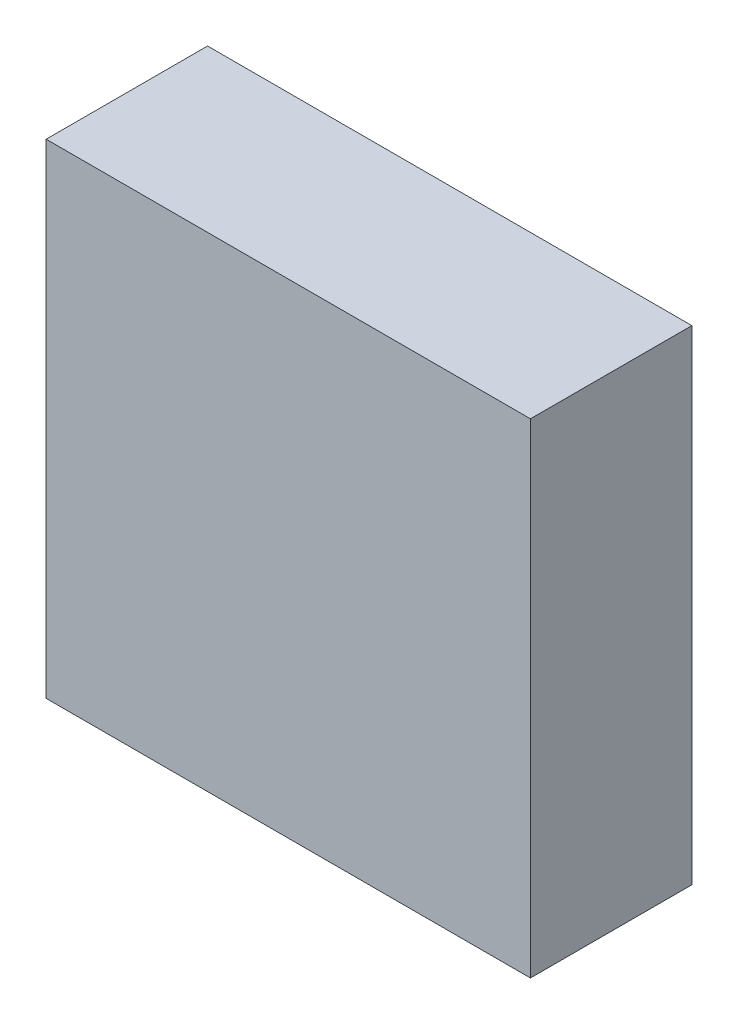
ISO-10303-21;
HEADER;
FILE_DESCRIPTION(('STEP AP214'),'2;1');
FILE_NAME('part.step','',(''),(''),'','','');
FILE_SCHEMA(('AUTOMOTIVE_DESIGN { 1 0 10303 214 1 1 1 1 }'));
ENDSEC;
DATA;
#1=APPLICATION_CONTEXT('core data for automotive mechanical design processes');
#2=APPLICATION_PROTOCOL_DEFINITION('international standard','automotive_design',2000,#1);
#3=PRODUCT_CONTEXT('',#1,'mechanical');
#4=PRODUCT('Part','Part','',(#3));
#5=PRODUCT_RELATED_PRODUCT_CATEGORY('part','',(#4));
#6=PRODUCT_DEFINITION_FORMATION('','',#4);
#7=PRODUCT_DEFINITION_CONTEXT('part definition',#1,'design');
#8=PRODUCT_DEFINITION('design','',#6,#7);
#9=PRODUCT_DEFINITION_SHAPE('','',#8);
#10=(LENGTH_UNIT() NAMED_UNIT(*) SI_UNIT(.MILLI.,.METRE.));
#11=(NAMED_UNIT(*) PLANE_ANGLE_UNIT() SI_UNIT($,.RADIAN.));
#12=(NAMED_UNIT(*) SI_UNIT($,.STERADIAN.) SOLID_ANGLE_UNIT());
#13=UNCERTAINTY_MEASURE_WITH_UNIT(LENGTH_MEASURE(1.E-05),#10,'distance_accuracy_value','');
#14=(GEOMETRIC_REPRESENTATION_CONTEXT(3) GLOBAL_UNCERTAINTY_ASSIGNED_CONTEXT((#13)) GLOBAL_UNIT_ASSIGNED_CONTEXT((#10,
#11,#12)) REPRESENTATION_CONTEXT('',''));
#15=CARTESIAN_POINT('',(0.,0.,0.));
#16=DIRECTION('',(0.,0.,1.));
#17=DIRECTION('',(1.,0.,0.));
#18=AXIS2_PLACEMENT_3D('',#15,#16,#17);
#19=CARTESIAN_POINT('',(15.,-15.,10.));
#20=DIRECTION('',(-1.,0.,0.));
#21=DIRECTION('',(0.,0.,1.));
#22=AXIS2_PLACEMENT_3D('',#19,#20,#21);
#23=PLANE('',#22);
#24=DIRECTION('',(0.,1.,0.));
#25=VECTOR('',#24,1.);
#26=CARTESIAN_POINT('',(15.,-15.,0.));
#27=LINE('',#26,#25);
#28=CARTESIAN_POINT('',(15.,-15.,0.));
#29=VERTEX_POINT('',#28);
#30=CARTESIAN_POINT('',(15.,15.,0.));
#31=VERTEX_POINT('',#30);
#32=EDGE_CURVE('E107',#29,#31,#27,.T.);
#33=ORIENTED_EDGE('',*,*,#32,.T.);
#34=DIRECTION('',(0.,0.,-1.));
#35=VECTOR('',#34,1.);
#36=CARTESIAN_POINT('',(15.,15.,10.));
#37=LINE('',#36,#35);
#38=CARTESIAN_POINT('',(15.,15.,10.));
#39=VERTEX_POINT('',#38);
#40=EDGE_CURVE('E11',#39,#31,#37,.T.);
#41=ORIENTED_EDGE('',*,*,#40,.F.);
#42=DIRECTION('',(0.,1.,0.));
#43=VECTOR('',#42,1.);
#44=CARTESIAN_POINT('',(15.,-15.,10.));
#45=LINE('',#44,#43);
#46=CARTESIAN_POINT('',(15.,-15.,10.));
#47=VERTEX_POINT('',#46);
#48=EDGE_CURVE('E91',#47,#39,#45,.T.);
#49=ORIENTED_EDGE('',*,*,#48,.F.);
#50=DIRECTION('',(0.,0.,-1.));
#51=VECTOR('',#50,1.);
#52=CARTESIAN_POINT('',(15.,-15.,10.));
#53=LINE('',#52,#51);
#54=EDGE_CURVE('E103',#47,#29,#53,.T.);
#55=ORIENTED_EDGE('',*,*,#54,.T.);
#56=EDGE_LOOP('',(#33,#41,#49,#55));
#57=FACE_BOUND('',#56,.T.);
#58=ADVANCED_FACE('F39',(#57),#23,.F.);
#59=CARTESIAN_POINT('',(-15.,15.,10.));
#60=DIRECTION('',(0.,-1.,0.));
#61=DIRECTION('',(0.,0.,-1.));
#62=AXIS2_PLACEMENT_3D('',#59,#60,#61);
#63=PLANE('',#62);
#64=DIRECTION('',(-1.,0.,0.));
#65=VECTOR('',#64,1.);
#66=CARTESIAN_POINT('',(-15.,15.,0.));
#67=LINE('',#66,#65);
#68=CARTESIAN_POINT('',(-15.,15.,0.));
#69=VERTEX_POINT('',#68);
#70=EDGE_CURVE('E96',#31,#69,#67,.T.);
#71=ORIENTED_EDGE('',*,*,#70,.T.);
#72=DIRECTION('',(0.,0.,-1.));
#73=VECTOR('',#72,1.);
#74=CARTESIAN_POINT('',(-15.,15.,10.));
#75=LINE('',#74,#73);
#76=CARTESIAN_POINT('',(-15.,15.,10.));
#77=VERTEX_POINT('',#76);
#78=EDGE_CURVE('E48',#77,#69,#75,.T.);
#79=ORIENTED_EDGE('',*,*,#78,.F.);
#80=DIRECTION('',(-1.,0.,0.));
#81=VECTOR('',#80,1.);
#82=CARTESIAN_POINT('',(-15.,15.,10.));
#83=LINE('',#82,#81);
#84=EDGE_CURVE('E86',#39,#77,#83,.T.);
#85=ORIENTED_EDGE('',*,*,#84,.F.);
#86=ORIENTED_EDGE('',*,*,#40,.T.);
#87=EDGE_LOOP('',(#71,#79,#85,#86));
#88=FACE_BOUND('',#87,.T.);
#89=ADVANCED_FACE('F95',(#88),#63,.F.);
#90=CARTESIAN_POINT('',(-15.,-15.,10.));
#91=DIRECTION('',(1.,0.,0.));
#92=DIRECTION('',(0.,0.,-1.));
#93=AXIS2_PLACEMENT_3D('',#90,#91,#92);
#94=PLANE('',#93);
#95=DIRECTION('',(0.,-1.,0.));
#96=VECTOR('',#95,1.);
#97=CARTESIAN_POINT('',(-15.,-15.,0.));
#98=LINE('',#97,#96);
#99=CARTESIAN_POINT('',(-15.,-15.,0.));
#100=VERTEX_POINT('',#99);
#101=EDGE_CURVE('E73',#69,#100,#98,.T.);
#102=ORIENTED_EDGE('',*,*,#101,.T.);
#103=DIRECTION('',(0.,0.,-1.));
#104=VECTOR('',#103,1.);
#105=CARTESIAN_POINT('',(-15.,-15.,10.));
#106=LINE('',#105,#104);
#107=CARTESIAN_POINT('',(-15.,-15.,10.));
#108=VERTEX_POINT('',#107);
#109=EDGE_CURVE('E98',#108,#100,#106,.T.);
#110=ORIENTED_EDGE('',*,*,#109,.F.);
#111=DIRECTION('',(0.,-1.,0.));
#112=VECTOR('',#111,1.);
#113=CARTESIAN_POINT('',(-15.,-15.,10.));
#114=LINE('',#113,#112);
#115=EDGE_CURVE('E89',#77,#108,#114,.T.);
#116=ORIENTED_EDGE('',*,*,#115,.F.);
#117=ORIENTED_EDGE('',*,*,#78,.T.);
#118=EDGE_LOOP('',(#102,#110,#116,#117));
#119=FACE_BOUND('',#118,.T.);
#120=ADVANCED_FACE('F99',(#119),#94,.F.);
#121=CARTESIAN_POINT('',(-15.,-15.,10.));
#122=DIRECTION('',(0.,1.,0.));
#123=DIRECTION('',(0.,0.,1.));
#124=AXIS2_PLACEMENT_3D('',#121,#122,#123);
#125=PLANE('',#124);
#126=DIRECTION('',(1.,0.,0.));
#127=VECTOR('',#126,1.);
#128=CARTESIAN_POINT('',(-15.,-15.,0.));
#129=LINE('',#128,#127);
#130=EDGE_CURVE('E79',#100,#29,#129,.T.);
#131=ORIENTED_EDGE('',*,*,#130,.T.);
#132=ORIENTED_EDGE('',*,*,#54,.F.);
#133=DIRECTION('',(1.,0.,0.));
#134=VECTOR('',#133,1.);
#135=CARTESIAN_POINT('',(-15.,-15.,10.));
#136=LINE('',#135,#134);
#137=EDGE_CURVE('E56',#108,#47,#136,.T.);
#138=ORIENTED_EDGE('',*,*,#137,.F.);
#139=ORIENTED_EDGE('',*,*,#109,.T.);
#140=EDGE_LOOP('',(#131,#132,#138,#139));
#141=FACE_BOUND('',#140,.T.);
#142=ADVANCED_FACE('F120',(#141),#125,.F.);
#143=CARTESIAN_POINT('',(0.,0.,10.));
#144=DIRECTION('',(0.,0.,-1.));
#145=DIRECTION('',(-1.,0.,0.));
#146=AXIS2_PLACEMENT_3D('',#143,#144,#145);
#147=PLANE('',#146);
#148=ORIENTED_EDGE('',*,*,#48,.T.);
#149=ORIENTED_EDGE('',*,*,#84,.T.);
#150=ORIENTED_EDGE('',*,*,#115,.T.);
#151=ORIENTED_EDGE('',*,*,#137,.T.);
#152=EDGE_LOOP('',(#148,#149,#150,#151));
#153=FACE_BOUND('',#152,.T.);
#154=ADVANCED_FACE('F87',(#153),#147,.F.);
#155=CARTESIAN_POINT('',(0.,0.,0.));
#156=DIRECTION('',(0.,0.,-1.));
#157=DIRECTION('',(-1.,0.,0.));
#158=AXIS2_PLACEMENT_3D('',#155,#156,#157);
#159=PLANE('',#158);
#160=ORIENTED_EDGE('',*,*,#32,.F.);
#161=ORIENTED_EDGE('',*,*,#130,.F.);
#162=ORIENTED_EDGE('',*,*,#101,.F.);
#163=ORIENTED_EDGE('',*,*,#70,.F.);
#164=EDGE_LOOP('',(#160,#161,#162,#163));
#165=FACE_BOUND('',#164,.T.);
#166=ADVANCED_FACE('F123',(#165),#159,.T.);
#167=CLOSED_SHELL('',(#58,#89,#120,#142,#154,#166));
#168=MANIFOLD_SOLID_BREP('B2',#167);
#169=ADVANCED_BREP_SHAPE_REPRESENTATION('',(#18,#168),#14);
#170=SHAPE_DEFINITION_REPRESENTATION(#9,#169);
ENDSEC;
END-ISO-10303-21;
